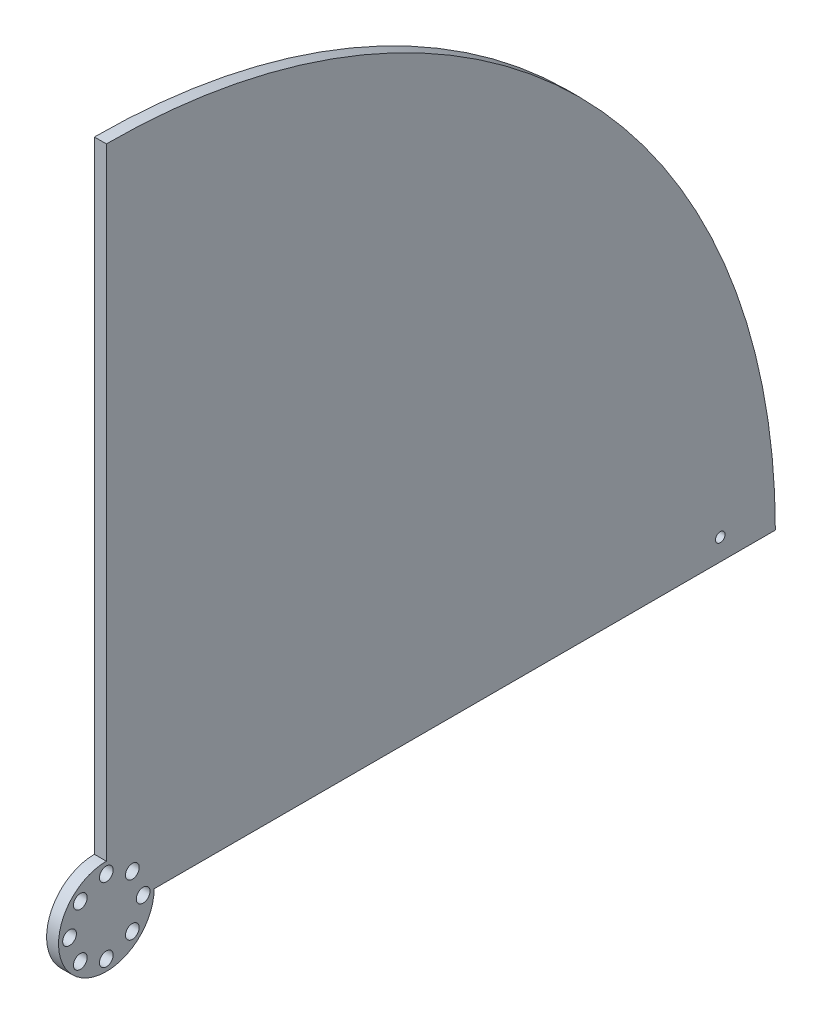
ISO-10303-21;
HEADER;
FILE_DESCRIPTION(('STEP AP214'),'2;1');
FILE_NAME('part.step','',(''),(''),'','','');
FILE_SCHEMA(('AUTOMOTIVE_DESIGN { 1 0 10303 214 1 1 1 1 }'));
ENDSEC;
DATA;
#1=APPLICATION_CONTEXT('core data for automotive mechanical design processes');
#2=APPLICATION_PROTOCOL_DEFINITION('international standard','automotive_design',2000,#1);
#3=PRODUCT_CONTEXT('',#1,'mechanical');
#4=PRODUCT('Part','Part','',(#3));
#5=PRODUCT_RELATED_PRODUCT_CATEGORY('part','',(#4));
#6=PRODUCT_DEFINITION_FORMATION('','',#4);
#7=PRODUCT_DEFINITION_CONTEXT('part definition',#1,'design');
#8=PRODUCT_DEFINITION('design','',#6,#7);
#9=PRODUCT_DEFINITION_SHAPE('','',#8);
#10=(LENGTH_UNIT() NAMED_UNIT(*) SI_UNIT(.MILLI.,.METRE.));
#11=(NAMED_UNIT(*) PLANE_ANGLE_UNIT() SI_UNIT($,.RADIAN.));
#12=(NAMED_UNIT(*) SI_UNIT($,.STERADIAN.) SOLID_ANGLE_UNIT());
#13=UNCERTAINTY_MEASURE_WITH_UNIT(LENGTH_MEASURE(1.E-05),#10,'distance_accuracy_value','');
#14=(GEOMETRIC_REPRESENTATION_CONTEXT(3) GLOBAL_UNCERTAINTY_ASSIGNED_CONTEXT((#13)) GLOBAL_UNIT_ASSIGNED_CONTEXT((#10,
#11,#12)) REPRESENTATION_CONTEXT('',''));
#15=CARTESIAN_POINT('',(0.,0.,0.));
#16=DIRECTION('',(0.,0.,1.));
#17=DIRECTION('',(1.,0.,0.));
#18=AXIS2_PLACEMENT_3D('',#15,#16,#17);
#19=CARTESIAN_POINT('',(3.175,0.,0.));
#20=DIRECTION('',(0.,1.,0.));
#21=DIRECTION('',(0.,0.,1.));
#22=AXIS2_PLACEMENT_3D('',#19,#20,#21);
#23=PLANE('',#22);
#24=DIRECTION('',(0.,0.,-1.));
#25=VECTOR('',#24,1.);
#26=CARTESIAN_POINT('',(3.175,0.,0.));
#27=LINE('',#26,#25);
#28=CARTESIAN_POINT('',(3.175,0.,-12.7));
#29=VERTEX_POINT('',#28);
#30=CARTESIAN_POINT('',(3.175,0.,-177.8));
#31=VERTEX_POINT('',#30);
#32=EDGE_CURVE('E54',#29,#31,#27,.T.);
#33=ORIENTED_EDGE('',*,*,#32,.F.);
#34=DIRECTION('',(1.,0.,0.));
#35=VECTOR('',#34,1.);
#36=CARTESIAN_POINT('',(0.,0.,-12.7));
#37=LINE('',#36,#35);
#38=CARTESIAN_POINT('',(0.,0.,-12.7));
#39=VERTEX_POINT('',#38);
#40=EDGE_CURVE('E88',#39,#29,#37,.T.);
#41=ORIENTED_EDGE('',*,*,#40,.F.);
#42=DIRECTION('',(0.,0.,-1.));
#43=VECTOR('',#42,1.);
#44=CARTESIAN_POINT('',(0.,0.,0.));
#45=LINE('',#44,#43);
#46=CARTESIAN_POINT('',(0.,0.,-177.8));
#47=VERTEX_POINT('',#46);
#48=EDGE_CURVE('E86',#39,#47,#45,.T.);
#49=ORIENTED_EDGE('',*,*,#48,.T.);
#50=DIRECTION('',(-1.,0.,0.));
#51=VECTOR('',#50,1.);
#52=CARTESIAN_POINT('',(3.175,0.,-177.8));
#53=LINE('',#52,#51);
#54=EDGE_CURVE('E11',#31,#47,#53,.T.);
#55=ORIENTED_EDGE('',*,*,#54,.F.);
#56=EDGE_LOOP('',(#33,#41,#49,#55));
#57=FACE_BOUND('',#56,.T.);
#58=ADVANCED_FACE('F32',(#57),#23,.F.);
#59=CARTESIAN_POINT('',(3.175,0.,0.));
#60=DIRECTION('',(-1.,0.,0.));
#61=DIRECTION('',(0.,0.,1.));
#62=AXIS2_PLACEMENT_3D('',#59,#60,#61);
#63=CYLINDRICAL_SURFACE('',#62,177.8);
#64=CARTESIAN_POINT('',(0.,0.,0.));
#65=DIRECTION('',(1.,0.,0.));
#66=DIRECTION('',(0.,0.,-1.));
#67=AXIS2_PLACEMENT_3D('',#64,#65,#66);
#68=CIRCLE('',#67,177.8);
#69=CARTESIAN_POINT('',(0.,177.8,0.));
#70=VERTEX_POINT('',#69);
#71=EDGE_CURVE('E92',#47,#70,#68,.T.);
#72=ORIENTED_EDGE('',*,*,#71,.T.);
#73=DIRECTION('',(-1.,0.,0.));
#74=VECTOR('',#73,1.);
#75=CARTESIAN_POINT('',(3.175,177.8,0.));
#76=LINE('',#75,#74);
#77=CARTESIAN_POINT('',(3.175,177.8,0.));
#78=VERTEX_POINT('',#77);
#79=EDGE_CURVE('E39',#78,#70,#76,.T.);
#80=ORIENTED_EDGE('',*,*,#79,.F.);
#81=CARTESIAN_POINT('',(3.175,0.,0.));
#82=DIRECTION('',(1.,0.,0.));
#83=DIRECTION('',(0.,0.,-1.));
#84=AXIS2_PLACEMENT_3D('',#81,#82,#83);
#85=CIRCLE('',#84,177.8);
#86=EDGE_CURVE('E74',#31,#78,#85,.T.);
#87=ORIENTED_EDGE('',*,*,#86,.F.);
#88=ORIENTED_EDGE('',*,*,#54,.T.);
#89=EDGE_LOOP('',(#72,#80,#87,#88));
#90=FACE_BOUND('',#89,.T.);
#91=ADVANCED_FACE('F81',(#90),#63,.T.);
#92=CARTESIAN_POINT('',(3.175,177.8,0.));
#93=DIRECTION('',(0.,0.,-1.));
#94=DIRECTION('',(-1.,0.,0.));
#95=AXIS2_PLACEMENT_3D('',#92,#93,#94);
#96=PLANE('',#95);
#97=DIRECTION('',(0.,-1.,0.));
#98=VECTOR('',#97,1.);
#99=CARTESIAN_POINT('',(0.,177.8,0.));
#100=LINE('',#99,#98);
#101=CARTESIAN_POINT('',(0.,12.7,0.));
#102=VERTEX_POINT('',#101);
#103=EDGE_CURVE('E78',#70,#102,#100,.T.);
#104=ORIENTED_EDGE('',*,*,#103,.T.);
#105=DIRECTION('',(1.,0.,0.));
#106=VECTOR('',#105,1.);
#107=CARTESIAN_POINT('',(0.,12.7,0.));
#108=LINE('',#107,#106);
#109=CARTESIAN_POINT('',(3.175,12.7,0.));
#110=VERTEX_POINT('',#109);
#111=EDGE_CURVE('E46',#102,#110,#108,.T.);
#112=ORIENTED_EDGE('',*,*,#111,.T.);
#113=DIRECTION('',(0.,-1.,0.));
#114=VECTOR('',#113,1.);
#115=CARTESIAN_POINT('',(3.175,177.8,0.));
#116=LINE('',#115,#114);
#117=EDGE_CURVE('E83',#78,#110,#116,.T.);
#118=ORIENTED_EDGE('',*,*,#117,.F.);
#119=ORIENTED_EDGE('',*,*,#79,.T.);
#120=EDGE_LOOP('',(#104,#112,#118,#119));
#121=FACE_BOUND('',#120,.T.);
#122=ADVANCED_FACE('F171',(#121),#96,.F.);
#123=CARTESIAN_POINT('',(3.175,0.,0.));
#124=DIRECTION('',(1.,0.,0.));
#125=DIRECTION('',(0.,0.,-1.));
#126=AXIS2_PLACEMENT_3D('',#123,#124,#125);
#127=PLANE('',#126);
#128=CARTESIAN_POINT('',(3.175,5.69763948240538,-163.159047332897));
#129=DIRECTION('',(1.,0.,0.));
#130=DIRECTION('',(0.,0.,-1.));
#131=AXIS2_PLACEMENT_3D('',#128,#129,#130);
#132=CIRCLE('',#131,1.27);
#133=CARTESIAN_POINT('',(3.175,5.69763948240538,-164.429047332897));
#134=VERTEX_POINT('',#133);
#135=EDGE_CURVE('E154',#134,#134,#132,.T.);
#136=ORIENTED_EDGE('',*,*,#135,.F.);
#137=EDGE_LOOP('',(#136));
#138=FACE_BOUND('',#137,.T.);
#139=CARTESIAN_POINT('',(3.175,6.91479721322295,6.91479721322313));
#140=DIRECTION('',(1.,0.,0.));
#141=DIRECTION('',(0.,0.,-1.));
#142=AXIS2_PLACEMENT_3D('',#139,#140,#141);
#143=CIRCLE('',#142,1.82880000000032);
#144=CARTESIAN_POINT('',(3.175,6.91479721322295,5.08599721322281));
#145=VERTEX_POINT('',#144);
#146=EDGE_CURVE('E148',#145,#145,#143,.T.);
#147=ORIENTED_EDGE('',*,*,#146,.F.);
#148=EDGE_LOOP('',(#147));
#149=FACE_BOUND('',#148,.T.);
#150=CARTESIAN_POINT('',(3.175,-4.16903844779881E-13,9.77899999999958));
#151=DIRECTION('',(1.,0.,0.));
#152=DIRECTION('',(0.,0.,-1.));
#153=AXIS2_PLACEMENT_3D('',#150,#151,#152);
#154=CIRCLE('',#153,1.82880000000062);
#155=CARTESIAN_POINT('',(3.175,-4.16903844779881E-13,7.95019999999897));
#156=VERTEX_POINT('',#155);
#157=EDGE_CURVE('E142',#156,#156,#154,.T.);
#158=ORIENTED_EDGE('',*,*,#157,.F.);
#159=EDGE_LOOP('',(#158));
#160=FACE_BOUND('',#159,.T.);
#161=CARTESIAN_POINT('',(3.175,-6.91479721322354,6.91479721322254));
#162=DIRECTION('',(1.,0.,0.));
#163=DIRECTION('',(0.,0.,-1.));
#164=AXIS2_PLACEMENT_3D('',#161,#162,#163);
#165=CIRCLE('',#164,1.82880000000084);
#166=CARTESIAN_POINT('',(3.175,-6.91479721322354,5.08599721322169));
#167=VERTEX_POINT('',#166);
#168=EDGE_CURVE('E136',#167,#167,#165,.T.);
#169=ORIENTED_EDGE('',*,*,#168,.F.);
#170=EDGE_LOOP('',(#169));
#171=FACE_BOUND('',#170,.T.);
#172=CARTESIAN_POINT('',(3.175,-9.779,-8.3141252534999E-13));
#173=DIRECTION('',(1.,0.,0.));
#174=DIRECTION('',(0.,0.,-1.));
#175=AXIS2_PLACEMENT_3D('',#172,#173,#174);
#176=CIRCLE('',#175,1.82880000000086);
#177=CARTESIAN_POINT('',(3.175,-9.779,-1.82880000000169));
#178=VERTEX_POINT('',#177);
#179=EDGE_CURVE('E130',#178,#178,#176,.T.);
#180=ORIENTED_EDGE('',*,*,#179,.F.);
#181=EDGE_LOOP('',(#180));
#182=FACE_BOUND('',#181,.T.);
#183=CARTESIAN_POINT('',(3.175,-6.91479721322295,-6.91479721322396));
#184=DIRECTION('',(1.,0.,0.));
#185=DIRECTION('',(0.,0.,-1.));
#186=AXIS2_PLACEMENT_3D('',#183,#184,#185);
#187=CIRCLE('',#186,1.82880000000064);
#188=CARTESIAN_POINT('',(3.175,-6.91479721322295,-8.7435972132246));
#189=VERTEX_POINT('',#188);
#190=EDGE_CURVE('E124',#189,#189,#187,.T.);
#191=ORIENTED_EDGE('',*,*,#190,.F.);
#192=EDGE_LOOP('',(#191));
#193=FACE_BOUND('',#192,.T.);
#194=CARTESIAN_POINT('',(3.175,4.15706262674995E-13,-9.77900000000041));
#195=DIRECTION('',(1.,0.,0.));
#196=DIRECTION('',(0.,0.,-1.));
#197=AXIS2_PLACEMENT_3D('',#194,#195,#196);
#198=CIRCLE('',#197,1.82880000000031);
#199=CARTESIAN_POINT('',(3.175,4.15706262674995E-13,-11.6078000000007));
#200=VERTEX_POINT('',#199);
#201=EDGE_CURVE('E118',#200,#200,#198,.T.);
#202=ORIENTED_EDGE('',*,*,#201,.F.);
#203=EDGE_LOOP('',(#202));
#204=FACE_BOUND('',#203,.T.);
#205=CARTESIAN_POINT('',(3.175,6.91479721322354,-6.91479721322337));
#206=DIRECTION('',(1.,0.,0.));
#207=DIRECTION('',(0.,0.,-1.));
#208=AXIS2_PLACEMENT_3D('',#205,#206,#207);
#209=CIRCLE('',#208,1.82880000000005);
#210=CARTESIAN_POINT('',(3.175,6.91479721322354,-8.74359721322342));
#211=VERTEX_POINT('',#210);
#212=EDGE_CURVE('E112',#211,#211,#209,.T.);
#213=ORIENTED_EDGE('',*,*,#212,.F.);
#214=EDGE_LOOP('',(#213));
#215=FACE_BOUND('',#214,.T.);
#216=CARTESIAN_POINT('',(3.175,9.779,0.));
#217=DIRECTION('',(1.,0.,0.));
#218=DIRECTION('',(0.,0.,-1.));
#219=AXIS2_PLACEMENT_3D('',#216,#217,#218);
#220=CIRCLE('',#219,1.8288);
#221=CARTESIAN_POINT('',(3.175,9.779,-1.8288));
#222=VERTEX_POINT('',#221);
#223=EDGE_CURVE('E106',#222,#222,#220,.T.);
#224=ORIENTED_EDGE('',*,*,#223,.F.);
#225=EDGE_LOOP('',(#224));
#226=FACE_BOUND('',#225,.T.);
#227=CARTESIAN_POINT('',(3.175,0.,0.));
#228=DIRECTION('',(1.,0.,0.));
#229=DIRECTION('',(0.,0.,-1.));
#230=AXIS2_PLACEMENT_3D('',#227,#228,#229);
#231=CIRCLE('',#230,12.7);
#232=EDGE_CURVE('E77',#110,#29,#231,.T.);
#233=ORIENTED_EDGE('',*,*,#232,.T.);
#234=ORIENTED_EDGE('',*,*,#32,.T.);
#235=ORIENTED_EDGE('',*,*,#86,.T.);
#236=ORIENTED_EDGE('',*,*,#117,.T.);
#237=EDGE_LOOP('',(#233,#234,#235,#236));
#238=FACE_BOUND('',#237,.T.);
#239=ADVANCED_FACE('F73',(#138,#149,#160,#171,#182,#193,#204,#215,#226,#238),#127,.T.);
#240=CARTESIAN_POINT('',(0.,0.,0.));
#241=DIRECTION('',(1.,0.,0.));
#242=DIRECTION('',(0.,0.,-1.));
#243=AXIS2_PLACEMENT_3D('',#240,#241,#242);
#244=PLANE('',#243);
#245=CARTESIAN_POINT('',(0.,5.69763948240538,-163.159047332897));
#246=DIRECTION('',(1.,0.,0.));
#247=DIRECTION('',(0.,0.,-1.));
#248=AXIS2_PLACEMENT_3D('',#245,#246,#247);
#249=CIRCLE('',#248,1.27);
#250=CARTESIAN_POINT('',(0.,5.69763948240538,-164.429047332897));
#251=VERTEX_POINT('',#250);
#252=EDGE_CURVE('E151',#251,#251,#249,.T.);
#253=ORIENTED_EDGE('',*,*,#252,.T.);
#254=EDGE_LOOP('',(#253));
#255=FACE_BOUND('',#254,.T.);
#256=CARTESIAN_POINT('',(0.,6.91479721322295,6.91479721322313));
#257=DIRECTION('',(1.,0.,0.));
#258=DIRECTION('',(0.,0.,-1.));
#259=AXIS2_PLACEMENT_3D('',#256,#257,#258);
#260=CIRCLE('',#259,1.82880000000032);
#261=CARTESIAN_POINT('',(0.,6.91479721322295,5.08599721322281));
#262=VERTEX_POINT('',#261);
#263=EDGE_CURVE('E145',#262,#262,#260,.T.);
#264=ORIENTED_EDGE('',*,*,#263,.T.);
#265=EDGE_LOOP('',(#264));
#266=FACE_BOUND('',#265,.T.);
#267=CARTESIAN_POINT('',(0.,-4.16903844779881E-13,9.77899999999958));
#268=DIRECTION('',(1.,0.,0.));
#269=DIRECTION('',(0.,0.,-1.));
#270=AXIS2_PLACEMENT_3D('',#267,#268,#269);
#271=CIRCLE('',#270,1.82880000000062);
#272=CARTESIAN_POINT('',(0.,-4.16903844779881E-13,7.95019999999897));
#273=VERTEX_POINT('',#272);
#274=EDGE_CURVE('E139',#273,#273,#271,.T.);
#275=ORIENTED_EDGE('',*,*,#274,.T.);
#276=EDGE_LOOP('',(#275));
#277=FACE_BOUND('',#276,.T.);
#278=CARTESIAN_POINT('',(0.,-6.91479721322354,6.91479721322254));
#279=DIRECTION('',(1.,0.,0.));
#280=DIRECTION('',(0.,0.,-1.));
#281=AXIS2_PLACEMENT_3D('',#278,#279,#280);
#282=CIRCLE('',#281,1.82880000000084);
#283=CARTESIAN_POINT('',(0.,-6.91479721322354,5.08599721322169));
#284=VERTEX_POINT('',#283);
#285=EDGE_CURVE('E133',#284,#284,#282,.T.);
#286=ORIENTED_EDGE('',*,*,#285,.T.);
#287=EDGE_LOOP('',(#286));
#288=FACE_BOUND('',#287,.T.);
#289=CARTESIAN_POINT('',(0.,-9.779,-8.3141252534999E-13));
#290=DIRECTION('',(1.,0.,0.));
#291=DIRECTION('',(0.,0.,-1.));
#292=AXIS2_PLACEMENT_3D('',#289,#290,#291);
#293=CIRCLE('',#292,1.82880000000086);
#294=CARTESIAN_POINT('',(0.,-9.779,-1.82880000000169));
#295=VERTEX_POINT('',#294);
#296=EDGE_CURVE('E127',#295,#295,#293,.T.);
#297=ORIENTED_EDGE('',*,*,#296,.T.);
#298=EDGE_LOOP('',(#297));
#299=FACE_BOUND('',#298,.T.);
#300=CARTESIAN_POINT('',(0.,-6.91479721322295,-6.91479721322396));
#301=DIRECTION('',(1.,0.,0.));
#302=DIRECTION('',(0.,0.,-1.));
#303=AXIS2_PLACEMENT_3D('',#300,#301,#302);
#304=CIRCLE('',#303,1.82880000000064);
#305=CARTESIAN_POINT('',(0.,-6.91479721322295,-8.7435972132246));
#306=VERTEX_POINT('',#305);
#307=EDGE_CURVE('E121',#306,#306,#304,.T.);
#308=ORIENTED_EDGE('',*,*,#307,.T.);
#309=EDGE_LOOP('',(#308));
#310=FACE_BOUND('',#309,.T.);
#311=CARTESIAN_POINT('',(0.,4.15706262674995E-13,-9.77900000000041));
#312=DIRECTION('',(1.,0.,0.));
#313=DIRECTION('',(0.,0.,-1.));
#314=AXIS2_PLACEMENT_3D('',#311,#312,#313);
#315=CIRCLE('',#314,1.82880000000031);
#316=CARTESIAN_POINT('',(0.,4.15706262674995E-13,-11.6078000000007));
#317=VERTEX_POINT('',#316);
#318=EDGE_CURVE('E115',#317,#317,#315,.T.);
#319=ORIENTED_EDGE('',*,*,#318,.T.);
#320=EDGE_LOOP('',(#319));
#321=FACE_BOUND('',#320,.T.);
#322=CARTESIAN_POINT('',(0.,6.91479721322354,-6.91479721322337));
#323=DIRECTION('',(1.,0.,0.));
#324=DIRECTION('',(0.,0.,-1.));
#325=AXIS2_PLACEMENT_3D('',#322,#323,#324);
#326=CIRCLE('',#325,1.82880000000005);
#327=CARTESIAN_POINT('',(0.,6.91479721322354,-8.74359721322342));
#328=VERTEX_POINT('',#327);
#329=EDGE_CURVE('E109',#328,#328,#326,.T.);
#330=ORIENTED_EDGE('',*,*,#329,.T.);
#331=EDGE_LOOP('',(#330));
#332=FACE_BOUND('',#331,.T.);
#333=CARTESIAN_POINT('',(0.,9.779,0.));
#334=DIRECTION('',(1.,0.,0.));
#335=DIRECTION('',(0.,0.,-1.));
#336=AXIS2_PLACEMENT_3D('',#333,#334,#335);
#337=CIRCLE('',#336,1.8288);
#338=CARTESIAN_POINT('',(0.,9.779,-1.8288));
#339=VERTEX_POINT('',#338);
#340=EDGE_CURVE('E104',#339,#339,#337,.T.);
#341=ORIENTED_EDGE('',*,*,#340,.T.);
#342=EDGE_LOOP('',(#341));
#343=FACE_BOUND('',#342,.T.);
#344=ORIENTED_EDGE('',*,*,#48,.F.);
#345=CARTESIAN_POINT('',(0.,0.,0.));
#346=DIRECTION('',(1.,0.,0.));
#347=DIRECTION('',(0.,0.,-1.));
#348=AXIS2_PLACEMENT_3D('',#345,#346,#347);
#349=CIRCLE('',#348,12.7);
#350=EDGE_CURVE('E101',#102,#39,#349,.T.);
#351=ORIENTED_EDGE('',*,*,#350,.F.);
#352=ORIENTED_EDGE('',*,*,#103,.F.);
#353=ORIENTED_EDGE('',*,*,#71,.F.);
#354=EDGE_LOOP('',(#344,#351,#352,#353));
#355=FACE_BOUND('',#354,.T.);
#356=ADVANCED_FACE('F95',(#255,#266,#277,#288,#299,#310,#321,#332,#343,#355),#244,.F.);
#357=CARTESIAN_POINT('',(0.,0.,0.));
#358=DIRECTION('',(1.,0.,0.));
#359=DIRECTION('',(0.,0.,-1.));
#360=AXIS2_PLACEMENT_3D('',#357,#358,#359);
#361=CYLINDRICAL_SURFACE('',#360,12.7);
#362=ORIENTED_EDGE('',*,*,#232,.F.);
#363=ORIENTED_EDGE('',*,*,#111,.F.);
#364=ORIENTED_EDGE('',*,*,#350,.T.);
#365=ORIENTED_EDGE('',*,*,#40,.T.);
#366=EDGE_LOOP('',(#362,#363,#364,#365));
#367=FACE_BOUND('',#366,.T.);
#368=ADVANCED_FACE('F192',(#367),#361,.T.);
#369=CARTESIAN_POINT('',(0.,9.779,0.));
#370=DIRECTION('',(1.,0.,0.));
#371=DIRECTION('',(0.,0.,-1.));
#372=AXIS2_PLACEMENT_3D('',#369,#370,#371);
#373=CYLINDRICAL_SURFACE('',#372,1.8288);
#374=ORIENTED_EDGE('',*,*,#340,.F.);
#375=EDGE_LOOP('',(#374));
#376=FACE_BOUND('',#375,.T.);
#377=ORIENTED_EDGE('',*,*,#223,.T.);
#378=EDGE_LOOP('',(#377));
#379=FACE_BOUND('',#378,.T.);
#380=ADVANCED_FACE('F189',(#376,#379),#373,.F.);
#381=CARTESIAN_POINT('',(0.,6.91479721322354,-6.91479721322337));
#382=DIRECTION('',(1.,0.,0.));
#383=DIRECTION('',(0.,0.,-1.));
#384=AXIS2_PLACEMENT_3D('',#381,#382,#383);
#385=CYLINDRICAL_SURFACE('',#384,1.82880000000005);
#386=ORIENTED_EDGE('',*,*,#329,.F.);
#387=EDGE_LOOP('',(#386));
#388=FACE_BOUND('',#387,.T.);
#389=ORIENTED_EDGE('',*,*,#212,.T.);
#390=EDGE_LOOP('',(#389));
#391=FACE_BOUND('',#390,.T.);
#392=ADVANCED_FACE('F191',(#388,#391),#385,.F.);
#393=CARTESIAN_POINT('',(0.,4.15706262674995E-13,-9.77900000000041));
#394=DIRECTION('',(1.,0.,0.));
#395=DIRECTION('',(0.,0.,-1.));
#396=AXIS2_PLACEMENT_3D('',#393,#394,#395);
#397=CYLINDRICAL_SURFACE('',#396,1.82880000000031);
#398=ORIENTED_EDGE('',*,*,#318,.F.);
#399=EDGE_LOOP('',(#398));
#400=FACE_BOUND('',#399,.T.);
#401=ORIENTED_EDGE('',*,*,#201,.T.);
#402=EDGE_LOOP('',(#401));
#403=FACE_BOUND('',#402,.T.);
#404=ADVANCED_FACE('F199',(#400,#403),#397,.F.);
#405=CARTESIAN_POINT('',(0.,-6.91479721322295,-6.91479721322396));
#406=DIRECTION('',(1.,0.,0.));
#407=DIRECTION('',(0.,0.,-1.));
#408=AXIS2_PLACEMENT_3D('',#405,#406,#407);
#409=CYLINDRICAL_SURFACE('',#408,1.82880000000064);
#410=ORIENTED_EDGE('',*,*,#307,.F.);
#411=EDGE_LOOP('',(#410));
#412=FACE_BOUND('',#411,.T.);
#413=ORIENTED_EDGE('',*,*,#190,.T.);
#414=EDGE_LOOP('',(#413));
#415=FACE_BOUND('',#414,.T.);
#416=ADVANCED_FACE('F256',(#412,#415),#409,.F.);
#417=CARTESIAN_POINT('',(0.,-9.779,-8.3141252534999E-13));
#418=DIRECTION('',(1.,0.,0.));
#419=DIRECTION('',(0.,0.,-1.));
#420=AXIS2_PLACEMENT_3D('',#417,#418,#419);
#421=CYLINDRICAL_SURFACE('',#420,1.82880000000086);
#422=ORIENTED_EDGE('',*,*,#296,.F.);
#423=EDGE_LOOP('',(#422));
#424=FACE_BOUND('',#423,.T.);
#425=ORIENTED_EDGE('',*,*,#179,.T.);
#426=EDGE_LOOP('',(#425));
#427=FACE_BOUND('',#426,.T.);
#428=ADVANCED_FACE('F248',(#424,#427),#421,.F.);
#429=CARTESIAN_POINT('',(0.,-6.91479721322354,6.91479721322254));
#430=DIRECTION('',(1.,0.,0.));
#431=DIRECTION('',(0.,0.,-1.));
#432=AXIS2_PLACEMENT_3D('',#429,#430,#431);
#433=CYLINDRICAL_SURFACE('',#432,1.82880000000084);
#434=ORIENTED_EDGE('',*,*,#285,.F.);
#435=EDGE_LOOP('',(#434));
#436=FACE_BOUND('',#435,.T.);
#437=ORIENTED_EDGE('',*,*,#168,.T.);
#438=EDGE_LOOP('',(#437));
#439=FACE_BOUND('',#438,.T.);
#440=ADVANCED_FACE('F240',(#436,#439),#433,.F.);
#441=CARTESIAN_POINT('',(0.,-4.16903844779881E-13,9.77899999999958));
#442=DIRECTION('',(1.,0.,0.));
#443=DIRECTION('',(0.,0.,-1.));
#444=AXIS2_PLACEMENT_3D('',#441,#442,#443);
#445=CYLINDRICAL_SURFACE('',#444,1.82880000000062);
#446=ORIENTED_EDGE('',*,*,#274,.F.);
#447=EDGE_LOOP('',(#446));
#448=FACE_BOUND('',#447,.T.);
#449=ORIENTED_EDGE('',*,*,#157,.T.);
#450=EDGE_LOOP('',(#449));
#451=FACE_BOUND('',#450,.T.);
#452=ADVANCED_FACE('F233',(#448,#451),#445,.F.);
#453=CARTESIAN_POINT('',(0.,6.91479721322295,6.91479721322313));
#454=DIRECTION('',(1.,0.,0.));
#455=DIRECTION('',(0.,0.,-1.));
#456=AXIS2_PLACEMENT_3D('',#453,#454,#455);
#457=CYLINDRICAL_SURFACE('',#456,1.82880000000032);
#458=ORIENTED_EDGE('',*,*,#263,.F.);
#459=EDGE_LOOP('',(#458));
#460=FACE_BOUND('',#459,.T.);
#461=ORIENTED_EDGE('',*,*,#146,.T.);
#462=EDGE_LOOP('',(#461));
#463=FACE_BOUND('',#462,.T.);
#464=ADVANCED_FACE('F165',(#460,#463),#457,.F.);
#465=CARTESIAN_POINT('',(0.,5.69763948240538,-163.159047332897));
#466=DIRECTION('',(1.,0.,0.));
#467=DIRECTION('',(0.,0.,-1.));
#468=AXIS2_PLACEMENT_3D('',#465,#466,#467);
#469=CYLINDRICAL_SURFACE('',#468,1.27);
#470=ORIENTED_EDGE('',*,*,#252,.F.);
#471=EDGE_LOOP('',(#470));
#472=FACE_BOUND('',#471,.T.);
#473=ORIENTED_EDGE('',*,*,#135,.T.);
#474=EDGE_LOOP('',(#473));
#475=FACE_BOUND('',#474,.T.);
#476=ADVANCED_FACE('F162',(#472,#475),#469,.F.);
#477=CLOSED_SHELL('',(#58,#91,#122,#239,#356,#368,#380,#392,#404,#416,#428,#440,#452,#464,#476));
#478=MANIFOLD_SOLID_BREP('B2',#477);
#479=ADVANCED_BREP_SHAPE_REPRESENTATION('',(#18,#478),#14);
#480=SHAPE_DEFINITION_REPRESENTATION(#9,#479);
ENDSEC;
END-ISO-10303-21;
